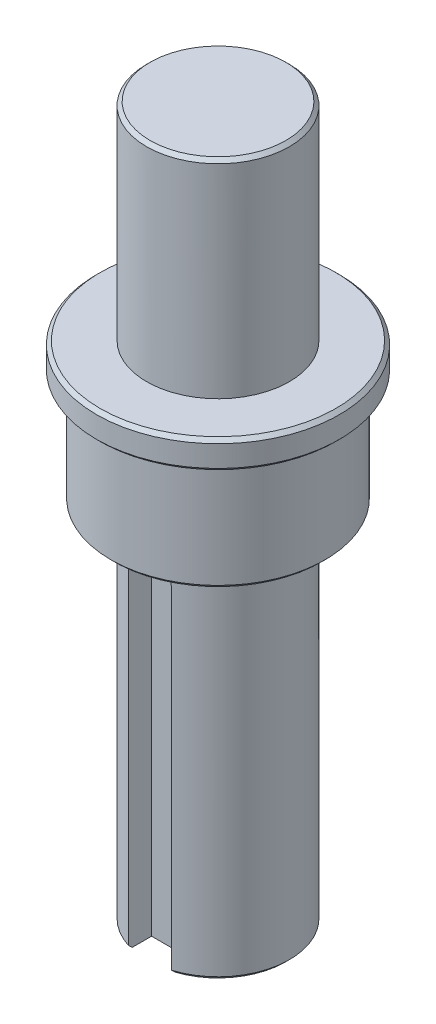
ISO-10303-21;
HEADER;
FILE_DESCRIPTION(('STEP AP214'),'2;1');
FILE_NAME('part.step','',(''),(''),'','','');
FILE_SCHEMA(('AUTOMOTIVE_DESIGN { 1 0 10303 214 1 1 1 1 }'));
ENDSEC;
DATA;
#1=APPLICATION_CONTEXT('core data for automotive mechanical design processes');
#2=APPLICATION_PROTOCOL_DEFINITION('international standard','automotive_design',2000,#1);
#3=PRODUCT_CONTEXT('',#1,'mechanical');
#4=PRODUCT('Part','Part','',(#3));
#5=PRODUCT_RELATED_PRODUCT_CATEGORY('part','',(#4));
#6=PRODUCT_DEFINITION_FORMATION('','',#4);
#7=PRODUCT_DEFINITION_CONTEXT('part definition',#1,'design');
#8=PRODUCT_DEFINITION('design','',#6,#7);
#9=PRODUCT_DEFINITION_SHAPE('','',#8);
#10=(LENGTH_UNIT() NAMED_UNIT(*) SI_UNIT(.MILLI.,.METRE.));
#11=(NAMED_UNIT(*) PLANE_ANGLE_UNIT() SI_UNIT($,.RADIAN.));
#12=(NAMED_UNIT(*) SI_UNIT($,.STERADIAN.) SOLID_ANGLE_UNIT());
#13=UNCERTAINTY_MEASURE_WITH_UNIT(LENGTH_MEASURE(1.E-05),#10,'distance_accuracy_value','');
#14=(GEOMETRIC_REPRESENTATION_CONTEXT(3) GLOBAL_UNCERTAINTY_ASSIGNED_CONTEXT((#13)) GLOBAL_UNIT_ASSIGNED_CONTEXT((#10,
#11,#12)) REPRESENTATION_CONTEXT('',''));
#15=CARTESIAN_POINT('',(0.,0.,0.));
#16=DIRECTION('',(0.,0.,1.));
#17=DIRECTION('',(1.,0.,0.));
#18=AXIS2_PLACEMENT_3D('',#15,#16,#17);
#19=CARTESIAN_POINT('',(0.,55.3655780461796,0.));
#20=DIRECTION('',(0.,1.,0.));
#21=DIRECTION('',(0.,0.,1.));
#22=AXIS2_PLACEMENT_3D('',#19,#20,#21);
#23=PLANE('',#22);
#24=CARTESIAN_POINT('',(0.,55.3655780461796,0.));
#25=DIRECTION('',(0.,1.,0.));
#26=DIRECTION('',(0.,0.,1.));
#27=AXIS2_PLACEMENT_3D('',#24,#25,#26);
#28=CIRCLE('',#27,4.75000000000002);
#29=CARTESIAN_POINT('',(0.,55.3655780461796,4.75000000000002));
#30=VERTEX_POINT('',#29);
#31=EDGE_CURVE('E164',#30,#30,#28,.T.);
#32=ORIENTED_EDGE('',*,*,#31,.T.);
#33=EDGE_LOOP('',(#32));
#34=FACE_BOUND('',#33,.T.);
#35=ADVANCED_FACE('F32',(#34),#23,.T.);
#36=CARTESIAN_POINT('',(0.,0.,0.));
#37=DIRECTION('',(0.,-1.,0.));
#38=DIRECTION('',(0.,0.,-1.));
#39=AXIS2_PLACEMENT_3D('',#36,#37,#38);
#40=CYLINDRICAL_SURFACE('',#39,5.);
#41=CARTESIAN_POINT('',(0.,55.1155780461796,0.));
#42=DIRECTION('',(0.,1.,0.));
#43=DIRECTION('',(0.,0.,1.));
#44=AXIS2_PLACEMENT_3D('',#41,#42,#43);
#45=CIRCLE('',#44,5.);
#46=CARTESIAN_POINT('',(0.,55.1155780461796,5.));
#47=VERTEX_POINT('',#46);
#48=EDGE_CURVE('E161',#47,#47,#45,.F.);
#49=ORIENTED_EDGE('',*,*,#48,.T.);
#50=EDGE_LOOP('',(#49));
#51=FACE_BOUND('',#50,.T.);
#52=CARTESIAN_POINT('',(0.,40.8655780461796,0.));
#53=DIRECTION('',(0.,-1.,0.));
#54=DIRECTION('',(0.,0.,-1.));
#55=AXIS2_PLACEMENT_3D('',#52,#53,#54);
#56=CIRCLE('',#55,5.);
#57=CARTESIAN_POINT('',(0.,40.8655780461796,-5.));
#58=VERTEX_POINT('',#57);
#59=EDGE_CURVE('E129',#58,#58,#56,.T.);
#60=ORIENTED_EDGE('',*,*,#59,.F.);
#61=EDGE_LOOP('',(#60));
#62=FACE_BOUND('',#61,.T.);
#63=ADVANCED_FACE('F238',(#51,#62),#40,.T.);
#64=CARTESIAN_POINT('',(5.,40.8655780461796,0.));
#65=DIRECTION('',(0.,1.,0.));
#66=DIRECTION('',(0.,0.,1.));
#67=AXIS2_PLACEMENT_3D('',#64,#65,#66);
#68=PLANE('',#67);
#69=CARTESIAN_POINT('',(0.,40.8655780461796,0.));
#70=DIRECTION('',(0.,1.,0.));
#71=DIRECTION('',(0.,0.,1.));
#72=AXIS2_PLACEMENT_3D('',#69,#70,#71);
#73=CIRCLE('',#72,8.24999999999998);
#74=CARTESIAN_POINT('',(0.,40.8655780461796,8.24999999999998));
#75=VERTEX_POINT('',#74);
#76=EDGE_CURVE('E147',#75,#75,#73,.T.);
#77=ORIENTED_EDGE('',*,*,#76,.T.);
#78=EDGE_LOOP('',(#77));
#79=FACE_BOUND('',#78,.T.);
#80=ORIENTED_EDGE('',*,*,#59,.T.);
#81=EDGE_LOOP('',(#80));
#82=FACE_BOUND('',#81,.T.);
#83=ADVANCED_FACE('F244',(#79,#82),#68,.T.);
#84=CARTESIAN_POINT('',(0.,0.,0.));
#85=DIRECTION('',(0.,-1.,0.));
#86=DIRECTION('',(0.,0.,-1.));
#87=AXIS2_PLACEMENT_3D('',#84,#85,#86);
#88=CYLINDRICAL_SURFACE('',#87,8.5);
#89=CARTESIAN_POINT('',(0.,39.1155780461796,0.));
#90=DIRECTION('',(0.,-1.,0.));
#91=DIRECTION('',(0.,0.,-1.));
#92=AXIS2_PLACEMENT_3D('',#89,#90,#91);
#93=CIRCLE('',#92,8.5);
#94=CARTESIAN_POINT('',(0.,39.1155780461796,-8.5));
#95=VERTEX_POINT('',#94);
#96=EDGE_CURVE('E144',#95,#95,#93,.F.);
#97=ORIENTED_EDGE('',*,*,#96,.T.);
#98=EDGE_LOOP('',(#97));
#99=FACE_BOUND('',#98,.T.);
#100=CARTESIAN_POINT('',(0.,40.6155780461796,0.));
#101=DIRECTION('',(0.,1.,0.));
#102=DIRECTION('',(0.,0.,1.));
#103=AXIS2_PLACEMENT_3D('',#100,#101,#102);
#104=CIRCLE('',#103,8.5);
#105=CARTESIAN_POINT('',(0.,40.6155780461796,8.5));
#106=VERTEX_POINT('',#105);
#107=EDGE_CURVE('E141',#106,#106,#104,.F.);
#108=ORIENTED_EDGE('',*,*,#107,.T.);
#109=EDGE_LOOP('',(#108));
#110=FACE_BOUND('',#109,.T.);
#111=ADVANCED_FACE('F348',(#99,#110),#88,.T.);
#112=CARTESIAN_POINT('',(8.5,38.8655780461796,0.));
#113=DIRECTION('',(0.,-1.,0.));
#114=DIRECTION('',(0.,0.,-1.));
#115=AXIS2_PLACEMENT_3D('',#112,#113,#114);
#116=PLANE('',#115);
#117=CARTESIAN_POINT('',(0.,38.8655780461796,0.));
#118=DIRECTION('',(0.,-1.,0.));
#119=DIRECTION('',(0.,0.,-1.));
#120=AXIS2_PLACEMENT_3D('',#117,#118,#119);
#121=CIRCLE('',#120,8.25);
#122=CARTESIAN_POINT('',(0.,38.8655780461796,-8.25));
#123=VERTEX_POINT('',#122);
#124=EDGE_CURVE('E138',#123,#123,#121,.T.);
#125=ORIENTED_EDGE('',*,*,#124,.T.);
#126=EDGE_LOOP('',(#125));
#127=FACE_BOUND('',#126,.T.);
#128=CARTESIAN_POINT('',(0.,38.8655780461796,0.));
#129=DIRECTION('',(0.,-1.,0.));
#130=DIRECTION('',(0.,0.,-1.));
#131=AXIS2_PLACEMENT_3D('',#128,#129,#130);
#132=CIRCLE('',#131,7.5);
#133=CARTESIAN_POINT('',(0.,38.8655780461796,-7.5));
#134=VERTEX_POINT('',#133);
#135=EDGE_CURVE('E126',#134,#134,#132,.T.);
#136=ORIENTED_EDGE('',*,*,#135,.F.);
#137=EDGE_LOOP('',(#136));
#138=FACE_BOUND('',#137,.T.);
#139=ADVANCED_FACE('F341',(#127,#138),#116,.T.);
#140=CARTESIAN_POINT('',(0.,0.,0.));
#141=DIRECTION('',(0.,-1.,0.));
#142=DIRECTION('',(0.,0.,-1.));
#143=AXIS2_PLACEMENT_3D('',#140,#141,#142);
#144=CYLINDRICAL_SURFACE('',#143,7.5);
#145=CARTESIAN_POINT('',(0.,31.3155780461796,0.));
#146=DIRECTION('',(0.,-1.,0.));
#147=DIRECTION('',(0.,0.,-1.));
#148=AXIS2_PLACEMENT_3D('',#145,#146,#147);
#149=CIRCLE('',#148,7.5);
#150=CARTESIAN_POINT('',(0.,31.3155780461796,-7.5));
#151=VERTEX_POINT('',#150);
#152=EDGE_CURVE('E135',#151,#151,#149,.F.);
#153=ORIENTED_EDGE('',*,*,#152,.T.);
#154=EDGE_LOOP('',(#153));
#155=FACE_BOUND('',#154,.T.);
#156=ORIENTED_EDGE('',*,*,#135,.T.);
#157=EDGE_LOOP('',(#156));
#158=FACE_BOUND('',#157,.T.);
#159=ADVANCED_FACE('F336',(#155,#158),#144,.T.);
#160=CARTESIAN_POINT('',(7.5,31.0655780461796,0.));
#161=DIRECTION('',(0.,-1.,0.));
#162=DIRECTION('',(0.,0.,-1.));
#163=AXIS2_PLACEMENT_3D('',#160,#161,#162);
#164=PLANE('',#163);
#165=CARTESIAN_POINT('',(0.,31.0655780461796,0.));
#166=DIRECTION('',(0.,-1.,0.));
#167=DIRECTION('',(0.,0.,-1.));
#168=AXIS2_PLACEMENT_3D('',#165,#166,#167);
#169=CIRCLE('',#168,7.25000000000002);
#170=CARTESIAN_POINT('',(0.,31.0655780461796,-7.25000000000002));
#171=VERTEX_POINT('',#170);
#172=EDGE_CURVE('E132',#171,#171,#169,.T.);
#173=ORIENTED_EDGE('',*,*,#172,.T.);
#174=EDGE_LOOP('',(#173));
#175=FACE_BOUND('',#174,.T.);
#176=CARTESIAN_POINT('',(0.,31.0655780461796,0.));
#177=DIRECTION('',(0.,-1.,0.));
#178=DIRECTION('',(0.,0.,-1.));
#179=AXIS2_PLACEMENT_3D('',#176,#177,#178);
#180=CIRCLE('',#179,5.);
#181=CARTESIAN_POINT('',(0.,31.0655780461796,-5.));
#182=VERTEX_POINT('',#181);
#183=EDGE_CURVE('E123',#182,#182,#180,.T.);
#184=ORIENTED_EDGE('',*,*,#183,.F.);
#185=EDGE_LOOP('',(#184));
#186=FACE_BOUND('',#185,.T.);
#187=ADVANCED_FACE('F210',(#175,#186),#164,.T.);
#188=CARTESIAN_POINT('',(0.,0.,0.));
#189=DIRECTION('',(0.,-1.,0.));
#190=DIRECTION('',(0.,0.,-1.));
#191=AXIS2_PLACEMENT_3D('',#188,#189,#190);
#192=CYLINDRICAL_SURFACE('',#191,5.);
#193=DIRECTION('',(0.,-1.,0.));
#194=VECTOR('',#193,1.);
#195=CARTESIAN_POINT('',(-1.5,0.,4.76969600708473));
#196=LINE('',#195,#194);
#197=CARTESIAN_POINT('',(-1.5,29.0655780461796,4.76969600708473));
#198=VERTEX_POINT('',#197);
#199=CARTESIAN_POINT('',(-1.5,5.81557804617957,4.76969600708473));
#200=VERTEX_POINT('',#199);
#201=EDGE_CURVE('E118',#198,#200,#196,.T.);
#202=ORIENTED_EDGE('',*,*,#201,.F.);
#203=CARTESIAN_POINT('',(-1.5,29.0655780461796,4.76969600708473));
#204=CARTESIAN_POINT('',(-1.50000085359987,29.1067588568557,4.76969248993095));
#205=CARTESIAN_POINT('',(-1.49830305374632,29.1479189250242,4.77023000663726));
#206=CARTESIAN_POINT('',(-1.49153727481279,29.2299248430673,4.77235113343356));
#207=CARTESIAN_POINT('',(-1.48647005385463,29.2707707615349,4.7739345082043));
#208=CARTESIAN_POINT('',(-1.46630065235378,29.3921740899327,4.78018533002168));
#209=CARTESIAN_POINT('',(-1.44623028637151,29.4718871065223,4.78635397305579));
#210=CARTESIAN_POINT('',(-1.39353147335906,29.6266123274067,4.80195939037488));
#211=CARTESIAN_POINT('',(-1.36090719903445,29.7016260840324,4.81139507864529));
#212=CARTESIAN_POINT('',(-1.28407985018232,29.8451724452828,4.8324653260204));
#213=CARTESIAN_POINT('',(-1.23987100279312,29.9137017953376,4.8441009806121));
#214=CARTESIAN_POINT('',(-1.13964930893702,30.0444432152147,4.86866818200433));
#215=CARTESIAN_POINT('',(-1.08333633607985,30.1064199966792,4.88162718483485));
#216=CARTESIAN_POINT('',(-0.961140113903204,30.2202123641536,4.90714781796852));
#217=CARTESIAN_POINT('',(-0.89525500200505,30.2720259679565,4.9197093703538));
#218=CARTESIAN_POINT('',(-0.754090160225416,30.3650558233472,4.94333592434221));
#219=CARTESIAN_POINT('',(-0.678642338077991,30.4060269492916,4.95436400128813));
#220=CARTESIAN_POINT('',(-0.521563369050344,30.4745847769378,4.97335005202751));
#221=CARTESIAN_POINT('',(-0.439937649841662,30.5021830732554,4.98131068415016));
#222=CARTESIAN_POINT('',(-0.298264456021696,30.5368470073067,4.99143710038863));
#223=CARTESIAN_POINT('',(-0.239166490668787,30.5475994120532,4.99462764738927));
#224=CARTESIAN_POINT('',(-0.12005739141902,30.5619720635374,4.998918178526));
#225=CARTESIAN_POINT('',(-0.0600465820525057,30.565594787908,5.00001888889585));
#226=CARTESIAN_POINT('',(0.,30.5655780461796,5.));
#227=B_SPLINE_CURVE_WITH_KNOTS('',3,(#203,#204,#205,#206,#207,#208,#209,#210,#211,#212,#213,
#214,#215,#216,#217,#218,#219,#220,#221,#222,#223,#224,#225,#226),.UNSPECIFIED.,.F.,.F.,(4,2,2,
2,2,2,2,2,2,2,2,4),(0.,0.123463321048064,0.24689887216849,0.492911372366583,0.738842172727399,
0.984895759946682,1.23795183323011,1.49105721311967,1.74947248420819,2.00766329935825,
2.1876802778492,2.36763468764484),.UNSPECIFIED.);
#228=CARTESIAN_POINT('',(0.,30.5655780461796,5.));
#229=VERTEX_POINT('',#228);
#230=EDGE_CURVE('E11',#198,#229,#227,.T.);
#231=ORIENTED_EDGE('',*,*,#230,.T.);
#232=CARTESIAN_POINT('',(0.,30.5655780461796,5.));
#233=CARTESIAN_POINT('',(0.0412230773899808,30.5655787870539,5.00000277613313));
#234=CARTESIAN_POINT('',(0.0824255570982469,30.5638776069156,4.99948958398081));
#235=CARTESIAN_POINT('',(0.164518730866948,30.5570976301866,4.99746087704899));
#236=CARTESIAN_POINT('',(0.205409485177794,30.5520195039418,4.9959455611979));
#237=CARTESIAN_POINT('',(0.326963301776202,30.5318028708759,4.98995381331756));
#238=CARTESIAN_POINT('',(0.406785158642714,30.5116816969559,4.98403118606551));
#239=CARTESIAN_POINT('',(0.561734538434264,30.4588351670383,4.96895678681409));
#240=CARTESIAN_POINT('',(0.636863069535107,30.4261125288633,4.95980571114645));
#241=CARTESIAN_POINT('',(0.780600785691843,30.3490549515031,4.93922435519071));
#242=CARTESIAN_POINT('',(0.849207204843492,30.3047151153591,4.92779311423827));
#243=CARTESIAN_POINT('',(0.97986969539363,30.2043564797735,4.90350796272656));
#244=CARTESIAN_POINT('',(1.0417124952522,30.1480671774607,4.8906250718143));
#245=CARTESIAN_POINT('',(1.15524422121796,30.025974419819,4.86505948668359));
#246=CARTESIAN_POINT('',(1.20693049442307,29.9601684865012,4.85237684556416));
#247=CARTESIAN_POINT('',(1.29981663905891,29.8190842149488,4.82833698781928));
#248=CARTESIAN_POINT('',(1.34075062074078,29.7436241491111,4.81701657361784));
#249=CARTESIAN_POINT('',(1.40923482373452,29.5865232188316,4.79742985037451));
#250=CARTESIAN_POINT('',(1.43679764279335,29.5048882562876,4.78916066835566));
#251=CARTESIAN_POINT('',(1.47137173672671,29.36331012738,4.77862845517374));
#252=CARTESIAN_POINT('',(1.48208442594249,29.3043243465226,4.77530350348452));
#253=CARTESIAN_POINT('',(1.49640626854262,29.1854306551123,4.7708262463819));
#254=CARTESIAN_POINT('',(1.5000169977961,29.1255229521007,4.76967345898471));
#255=CARTESIAN_POINT('',(1.5,29.0655780461796,4.76969600708473));
#256=B_SPLINE_CURVE_WITH_KNOTS('',3,(#232,#233,#234,#235,#236,#237,#238,#239,#240,#241,#242,
#243,#244,#245,#246,#247,#248,#249,#250,#251,#252,#253,#254,#255),.UNSPECIFIED.,.F.,.F.,(4,2,2,
2,2,2,2,2,2,2,2,4),(0.,0.123590522760266,0.247156519315276,0.493467728235494,0.73972584367575,
0.98608793095597,1.23877207809718,1.49152213929097,1.75003354782293,2.00830092246139,
2.18798745648376,2.36763411497588),.UNSPECIFIED.);
#257=CARTESIAN_POINT('',(1.5,29.0655780461796,4.76969600708473));
#258=VERTEX_POINT('',#257);
#259=EDGE_CURVE('E42',#229,#258,#256,.T.);
#260=ORIENTED_EDGE('',*,*,#259,.T.);
#261=DIRECTION('',(0.,-1.,0.));
#262=VECTOR('',#261,1.);
#263=CARTESIAN_POINT('',(1.5,0.,4.76969600708473));
#264=LINE('',#263,#262);
#265=CARTESIAN_POINT('',(1.5,5.81557804617957,4.76969600708473));
#266=VERTEX_POINT('',#265);
#267=EDGE_CURVE('E114',#266,#258,#264,.F.);
#268=ORIENTED_EDGE('',*,*,#267,.F.);
#269=CARTESIAN_POINT('',(0.,5.81557804617957,0.));
#270=DIRECTION('',(0.,-1.,0.));
#271=DIRECTION('',(0.,0.,-1.));
#272=AXIS2_PLACEMENT_3D('',#269,#270,#271);
#273=CIRCLE('',#272,5.);
#274=EDGE_CURVE('E158',#266,#200,#273,.F.);
#275=ORIENTED_EDGE('',*,*,#274,.T.);
#276=EDGE_LOOP('',(#202,#231,#260,#268,#275));
#277=FACE_BOUND('',#276,.T.);
#278=ORIENTED_EDGE('',*,*,#183,.T.);
#279=EDGE_LOOP('',(#278));
#280=FACE_BOUND('',#279,.T.);
#281=ADVANCED_FACE('F206',(#277,#280),#192,.T.);
#282=CARTESIAN_POINT('',(5.,5.56557804617958,0.));
#283=DIRECTION('',(0.,-1.,0.));
#284=DIRECTION('',(0.,0.,-1.));
#285=AXIS2_PLACEMENT_3D('',#282,#283,#284);
#286=PLANE('',#285);
#287=DIRECTION('',(0.,0.,-1.));
#288=VECTOR('',#287,1.);
#289=CARTESIAN_POINT('',(-1.5,5.56557804617958,6.15));
#290=LINE('',#289,#288);
#291=CARTESIAN_POINT('',(-1.5,5.56557804617958,4.50693909432999));
#292=VERTEX_POINT('',#291);
#293=CARTESIAN_POINT('',(-1.5,5.56557804617958,3.15));
#294=VERTEX_POINT('',#293);
#295=EDGE_CURVE('E101',#292,#294,#290,.T.);
#296=ORIENTED_EDGE('',*,*,#295,.F.);
#297=CARTESIAN_POINT('',(0.,5.56557804617958,0.));
#298=DIRECTION('',(0.,-1.,0.));
#299=DIRECTION('',(0.,0.,-1.));
#300=AXIS2_PLACEMENT_3D('',#297,#298,#299);
#301=CIRCLE('',#300,4.75);
#302=CARTESIAN_POINT('',(1.5,5.56557804617958,4.50693909432999));
#303=VERTEX_POINT('',#302);
#304=EDGE_CURVE('E153',#292,#303,#301,.T.);
#305=ORIENTED_EDGE('',*,*,#304,.T.);
#306=DIRECTION('',(0.,0.,1.));
#307=VECTOR('',#306,1.);
#308=CARTESIAN_POINT('',(1.5,5.56557804617958,6.15));
#309=LINE('',#308,#307);
#310=CARTESIAN_POINT('',(1.5,5.56557804617958,3.15));
#311=VERTEX_POINT('',#310);
#312=EDGE_CURVE('E98',#311,#303,#309,.T.);
#313=ORIENTED_EDGE('',*,*,#312,.F.);
#314=DIRECTION('',(1.,0.,0.));
#315=VECTOR('',#314,1.);
#316=CARTESIAN_POINT('',(-1.5,5.56557804617958,3.15));
#317=LINE('',#316,#315);
#318=EDGE_CURVE('E93',#294,#311,#317,.T.);
#319=ORIENTED_EDGE('',*,*,#318,.F.);
#320=EDGE_LOOP('',(#296,#305,#313,#319));
#321=FACE_BOUND('',#320,.T.);
#322=CARTESIAN_POINT('',(0.,5.56557804617958,0.));
#323=DIRECTION('',(0.,-1.,0.));
#324=DIRECTION('',(0.,0.,-1.));
#325=AXIS2_PLACEMENT_3D('',#322,#323,#324);
#326=CIRCLE('',#325,1.9);
#327=CARTESIAN_POINT('',(0.,5.56557804617958,-1.9));
#328=VERTEX_POINT('',#327);
#329=EDGE_CURVE('E155',#328,#328,#326,.F.);
#330=ORIENTED_EDGE('',*,*,#329,.T.);
#331=EDGE_LOOP('',(#330));
#332=FACE_BOUND('',#331,.T.);
#333=ADVANCED_FACE('F109',(#321,#332),#286,.T.);
#334=CARTESIAN_POINT('',(0.,15.5655780461796,0.));
#335=DIRECTION('',(0.,-1.,0.));
#336=DIRECTION('',(0.,0.,-1.));
#337=AXIS2_PLACEMENT_3D('',#334,#335,#336);
#338=CONICAL_SURFACE('',#337,1.65,1.02974425867665);
#339=CARTESIAN_POINT('',(0.,16.5569980675751,0.));
#340=VERTEX_POINT('',#339);
#341=VERTEX_LOOP('',#340);
#342=FACE_BOUND('',#341,.T.);
#343=CARTESIAN_POINT('',(0.,15.5655780461796,0.));
#344=DIRECTION('',(0.,-1.,0.));
#345=DIRECTION('',(0.,0.,-1.));
#346=AXIS2_PLACEMENT_3D('',#343,#344,#345);
#347=CIRCLE('',#346,1.65);
#348=CARTESIAN_POINT('',(0.,15.5655780461796,-1.65));
#349=VERTEX_POINT('',#348);
#350=EDGE_CURVE('E120',#349,#349,#347,.T.);
#351=ORIENTED_EDGE('',*,*,#350,.T.);
#352=EDGE_LOOP('',(#351));
#353=FACE_BOUND('',#352,.T.);
#354=ADVANCED_FACE('F199',(#342,#353),#338,.F.);
#355=CARTESIAN_POINT('',(0.,5.56557804617958,0.));
#356=DIRECTION('',(0.,-1.,0.));
#357=DIRECTION('',(0.,0.,-1.));
#358=AXIS2_PLACEMENT_3D('',#355,#356,#357);
#359=CYLINDRICAL_SURFACE('',#358,1.65);
#360=CARTESIAN_POINT('',(0.,5.81557804617958,0.));
#361=DIRECTION('',(0.,-1.,0.));
#362=DIRECTION('',(0.,0.,-1.));
#363=AXIS2_PLACEMENT_3D('',#360,#361,#362);
#364=CIRCLE('',#363,1.65);
#365=CARTESIAN_POINT('',(0.,5.81557804617958,-1.65));
#366=VERTEX_POINT('',#365);
#367=EDGE_CURVE('E150',#366,#366,#364,.T.);
#368=ORIENTED_EDGE('',*,*,#367,.T.);
#369=EDGE_LOOP('',(#368));
#370=FACE_BOUND('',#369,.T.);
#371=ORIENTED_EDGE('',*,*,#350,.F.);
#372=EDGE_LOOP('',(#371));
#373=FACE_BOUND('',#372,.T.);
#374=ADVANCED_FACE('F195',(#370,#373),#359,.F.);
#375=CARTESIAN_POINT('',(0.,31.0655780461796,0.));
#376=DIRECTION('',(0.,1.,0.));
#377=DIRECTION('',(0.,0.,1.));
#378=AXIS2_PLACEMENT_3D('',#375,#376,#377);
#379=CONICAL_SURFACE('',#378,7.25000000000002,0.785398163397443);
#380=ORIENTED_EDGE('',*,*,#152,.F.);
#381=EDGE_LOOP('',(#380));
#382=FACE_BOUND('',#381,.T.);
#383=ORIENTED_EDGE('',*,*,#172,.F.);
#384=EDGE_LOOP('',(#383));
#385=FACE_BOUND('',#384,.T.);
#386=ADVANCED_FACE('F198',(#382,#385),#379,.T.);
#387=CARTESIAN_POINT('',(0.,38.8655780461796,0.));
#388=DIRECTION('',(0.,1.,0.));
#389=DIRECTION('',(0.,0.,1.));
#390=AXIS2_PLACEMENT_3D('',#387,#388,#389);
#391=CONICAL_SURFACE('',#390,8.25,0.785398163397448);
#392=ORIENTED_EDGE('',*,*,#96,.F.);
#393=EDGE_LOOP('',(#392));
#394=FACE_BOUND('',#393,.T.);
#395=ORIENTED_EDGE('',*,*,#124,.F.);
#396=EDGE_LOOP('',(#395));
#397=FACE_BOUND('',#396,.T.);
#398=ADVANCED_FACE('F251',(#394,#397),#391,.T.);
#399=CARTESIAN_POINT('',(0.,40.6155780461796,0.));
#400=DIRECTION('',(0.,-1.,0.));
#401=DIRECTION('',(0.,0.,-1.));
#402=AXIS2_PLACEMENT_3D('',#399,#400,#401);
#403=CONICAL_SURFACE('',#402,8.5,0.785398163397455);
#404=ORIENTED_EDGE('',*,*,#76,.F.);
#405=EDGE_LOOP('',(#404));
#406=FACE_BOUND('',#405,.T.);
#407=ORIENTED_EDGE('',*,*,#107,.F.);
#408=EDGE_LOOP('',(#407));
#409=FACE_BOUND('',#408,.T.);
#410=ADVANCED_FACE('F255',(#406,#409),#403,.T.);
#411=CARTESIAN_POINT('',(0.,5.81557804617958,0.));
#412=DIRECTION('',(0.,-1.,0.));
#413=DIRECTION('',(0.,0.,-1.));
#414=AXIS2_PLACEMENT_3D('',#411,#412,#413);
#415=CONICAL_SURFACE('',#414,1.65,0.785398163397437);
#416=ORIENTED_EDGE('',*,*,#329,.F.);
#417=EDGE_LOOP('',(#416));
#418=FACE_BOUND('',#417,.T.);
#419=ORIENTED_EDGE('',*,*,#367,.F.);
#420=EDGE_LOOP('',(#419));
#421=FACE_BOUND('',#420,.T.);
#422=ADVANCED_FACE('F233',(#418,#421),#415,.F.);
#423=CARTESIAN_POINT('',(0.,5.56557804617958,0.));
#424=DIRECTION('',(0.,1.,0.));
#425=DIRECTION('',(0.,0.,1.));
#426=AXIS2_PLACEMENT_3D('',#423,#424,#425);
#427=CONICAL_SURFACE('',#426,4.75,0.785398163397455);
#428=CARTESIAN_POINT('',(-1.5,7.89533460774791,6.91902832564446));
#429=CARTESIAN_POINT('',(-1.5,7.69647598334168,6.71553036797981));
#430=CARTESIAN_POINT('',(-1.5,7.49779954301674,6.51185357771266));
#431=CARTESIAN_POINT('',(-1.5,7.10098930384228,6.10398960654604));
#432=CARTESIAN_POINT('',(-1.5,6.90285548158691,5.89980244841184));
#433=CARTESIAN_POINT('',(-1.5,6.5073678458266,5.49082637246406));
#434=CARTESIAN_POINT('',(-1.5,6.31001376007984,5.28603771817635));
#435=CARTESIAN_POINT('',(-1.5,5.91628042457067,4.87550503869363));
#436=CARTESIAN_POINT('',(-1.5,5.7199012243852,4.66976096592086));
#437=CARTESIAN_POINT('',(-1.5,5.32845111293506,4.25680529238506));
#438=CARTESIAN_POINT('',(-1.5,5.13338101159559,4.04959292165795));
#439=CARTESIAN_POINT('',(-1.5,4.8424390790512,3.73724813314499));
#440=CARTESIAN_POINT('',(-1.5,4.74574148899583,3.6328852475839));
#441=CARTESIAN_POINT('',(-1.5,4.55305150555913,3.42350587425253));
#442=CARTESIAN_POINT('',(-1.5,4.4570591264121,3.31848937336798));
#443=CARTESIAN_POINT('',(-1.5,4.26594122041828,3.10757123419417));
#444=CARTESIAN_POINT('',(-1.5,4.17081616218705,3.00166917054749));
#445=CARTESIAN_POINT('',(-1.5,3.98179320751965,2.78878442607102));
#446=CARTESIAN_POINT('',(-1.5,3.88789524217197,2.68180180652687));
#447=CARTESIAN_POINT('',(-1.5,3.7017325294011,2.46634201067023));
#448=CARTESIAN_POINT('',(-1.5,3.60946845916267,2.35786424633837));
#449=CARTESIAN_POINT('',(-1.5,3.47285965508976,2.19364182998888));
#450=CARTESIAN_POINT('',(-1.5,3.42761703293877,2.13864473575473));
#451=CARTESIAN_POINT('',(-1.5,3.33786793225311,2.02804855440028));
#452=CARTESIAN_POINT('',(-1.5,3.29336149481503,1.97244943395737));
#453=CARTESIAN_POINT('',(-1.5,3.24929430164179,1.91650066843216));
#454=B_SPLINE_CURVE_WITH_KNOTS('',3,(#428,#429,#430,#431,#432,#433,#434,#435,#436,#437,#438,
#439,#440,#441,#442,#443,#444,#445,#446,#447,#448,#449,#450,#451,#452,#453),.UNSPECIFIED.,.F.,
.F.,(4,2,2,2,2,2,2,2,2,2,2,2,4),(0.,0.853584670418638,1.70713192247078,2.56034877988345,
3.41360859129956,4.26735498184592,4.69417608101149,5.12100577178529,5.54805383278679,
5.9750778075097,6.40227480935119,6.61591414221781,6.82956536125783),.UNSPECIFIED.);
#455=EDGE_CURVE('E104',#200,#292,#454,.T.);
#456=ORIENTED_EDGE('',*,*,#455,.F.);
#457=ORIENTED_EDGE('',*,*,#274,.F.);
#458=CARTESIAN_POINT('',(1.5,3.24929430164179,1.91650066843216));
#459=CARTESIAN_POINT('',(1.5,3.32302412288285,2.01004380284105));
#460=CARTESIAN_POINT('',(1.5,3.39792495714748,2.10264501170143));
#461=CARTESIAN_POINT('',(1.5,3.54953814779825,2.286332118577));
#462=CARTESIAN_POINT('',(1.5,3.62625023437719,2.37741823887959));
#463=CARTESIAN_POINT('',(1.5,3.78095218870356,2.55844148706309));
#464=CARTESIAN_POINT('',(1.5,3.85894162911681,2.64837898198863));
#465=CARTESIAN_POINT('',(1.5,4.01592507115388,2.82737869688168));
#466=CARTESIAN_POINT('',(1.5,4.09491911544865,2.91644087938317));
#467=CARTESIAN_POINT('',(1.5,4.33296946533679,3.1825083203277));
#468=CARTESIAN_POINT('',(1.5,4.49317305647103,3.3584859783545));
#469=CARTESIAN_POINT('',(1.5,4.81552443674137,3.7086663476505));
#470=CARTESIAN_POINT('',(1.5,4.9776723630063,3.88286893210659));
#471=CARTESIAN_POINT('',(1.5,5.20425174871498,4.12444003880721));
#472=CARTESIAN_POINT('',(1.5,5.26812352187248,4.19233446960438));
#473=CARTESIAN_POINT('',(1.5,5.39604850698609,4.3279575977517));
#474=CARTESIAN_POINT('',(1.5,5.46010172645213,4.39568628801917));
#475=CARTESIAN_POINT('',(1.5,5.71995134681018,4.66982075394263));
#476=CARTESIAN_POINT('',(1.5,5.91638805027015,4.87561965678679));
#477=CARTESIAN_POINT('',(1.5,6.31024431246382,5.28627570759393));
#478=CARTESIAN_POINT('',(1.5,6.50766387767489,5.49113284933324));
#479=CARTESIAN_POINT('',(1.5,6.90316343000021,5.90012054678869));
#480=CARTESIAN_POINT('',(1.5,7.10124326135089,6.10425125321795));
#481=CARTESIAN_POINT('',(1.5,7.49793306612436,6.51199021657896));
#482=CARTESIAN_POINT('',(1.5,7.69654303038245,6.71559848242461));
#483=CARTESIAN_POINT('',(1.5,7.89533460774791,6.91902832564446));
#484=B_SPLINE_CURVE_WITH_KNOTS('',3,(#458,#459,#460,#461,#462,#463,#464,#465,#466,#467,#468,
#469,#470,#471,#472,#473,#474,#475,#476,#477,#478,#479,#480,#481,#482,#483),.UNSPECIFIED.,.F.,
.F.,(4,2,2,2,2,2,2,2,2,2,2,2,4),(0.,0.357289307053713,0.714525723346356,1.07164497444426,
1.42877944532866,2.14268564208744,2.8566424884237,3.13629080885794,3.41595087798695,
4.26944687365721,5.12294850160169,5.97626131375108,6.82955946852391),.UNSPECIFIED.);
#485=EDGE_CURVE('E167',#303,#266,#484,.T.);
#486=ORIENTED_EDGE('',*,*,#485,.F.);
#487=ORIENTED_EDGE('',*,*,#304,.F.);
#488=EDGE_LOOP('',(#456,#457,#486,#487));
#489=FACE_BOUND('',#488,.T.);
#490=ADVANCED_FACE('F181',(#489),#427,.T.);
#491=CARTESIAN_POINT('',(0.,55.1155780461796,0.));
#492=DIRECTION('',(0.,-1.,0.));
#493=DIRECTION('',(0.,0.,-1.));
#494=AXIS2_PLACEMENT_3D('',#491,#492,#493);
#495=CONICAL_SURFACE('',#494,5.,0.785398163397428);
#496=ORIENTED_EDGE('',*,*,#31,.F.);
#497=EDGE_LOOP('',(#496));
#498=FACE_BOUND('',#497,.T.);
#499=ORIENTED_EDGE('',*,*,#48,.F.);
#500=EDGE_LOOP('',(#499));
#501=FACE_BOUND('',#500,.T.);
#502=ADVANCED_FACE('F194',(#498,#501),#495,.T.);
#503=CARTESIAN_POINT('',(-1.5,30.5655780461796,6.15));
#504=DIRECTION('',(-1.,0.,0.));
#505=DIRECTION('',(0.,0.,1.));
#506=AXIS2_PLACEMENT_3D('',#503,#504,#505);
#507=PLANE('',#506);
#508=DIRECTION('',(0.,-1.,0.));
#509=VECTOR('',#508,1.);
#510=CARTESIAN_POINT('',(-1.5,30.5655780461796,3.15));
#511=LINE('',#510,#509);
#512=CARTESIAN_POINT('',(-1.5,29.0655780461796,3.15));
#513=VERTEX_POINT('',#512);
#514=EDGE_CURVE('E88',#513,#294,#511,.T.);
#515=ORIENTED_EDGE('',*,*,#514,.F.);
#516=DIRECTION('',(0.,0.,-1.));
#517=VECTOR('',#516,1.);
#518=CARTESIAN_POINT('',(-1.5,29.0655780461796,6.15));
#519=LINE('',#518,#517);
#520=EDGE_CURVE('E55',#513,#198,#519,.F.);
#521=ORIENTED_EDGE('',*,*,#520,.T.);
#522=ORIENTED_EDGE('',*,*,#201,.T.);
#523=ORIENTED_EDGE('',*,*,#455,.T.);
#524=ORIENTED_EDGE('',*,*,#295,.T.);
#525=EDGE_LOOP('',(#515,#521,#522,#523,#524));
#526=FACE_BOUND('',#525,.T.);
#527=ADVANCED_FACE('F102',(#526),#507,.F.);
#528=CARTESIAN_POINT('',(1.5,30.5655780461796,6.15));
#529=DIRECTION('',(1.,0.,0.));
#530=DIRECTION('',(0.,0.,-1.));
#531=AXIS2_PLACEMENT_3D('',#528,#529,#530);
#532=PLANE('',#531);
#533=ORIENTED_EDGE('',*,*,#267,.T.);
#534=DIRECTION('',(0.,0.,1.));
#535=VECTOR('',#534,1.);
#536=CARTESIAN_POINT('',(1.5,29.0655780461796,6.15));
#537=LINE('',#536,#535);
#538=CARTESIAN_POINT('',(1.5,29.0655780461796,3.15));
#539=VERTEX_POINT('',#538);
#540=EDGE_CURVE('E325',#258,#539,#537,.F.);
#541=ORIENTED_EDGE('',*,*,#540,.T.);
#542=DIRECTION('',(0.,-1.,0.));
#543=VECTOR('',#542,1.);
#544=CARTESIAN_POINT('',(1.5,30.5655780461796,3.15));
#545=LINE('',#544,#543);
#546=EDGE_CURVE('E97',#539,#311,#545,.T.);
#547=ORIENTED_EDGE('',*,*,#546,.T.);
#548=ORIENTED_EDGE('',*,*,#312,.T.);
#549=ORIENTED_EDGE('',*,*,#485,.T.);
#550=EDGE_LOOP('',(#533,#541,#547,#548,#549));
#551=FACE_BOUND('',#550,.T.);
#552=ADVANCED_FACE('F185',(#551),#532,.F.);
#553=CARTESIAN_POINT('',(-1.5,30.5655780461796,3.15));
#554=DIRECTION('',(0.,0.,-1.));
#555=DIRECTION('',(-1.,0.,0.));
#556=AXIS2_PLACEMENT_3D('',#553,#554,#555);
#557=PLANE('',#556);
#558=ORIENTED_EDGE('',*,*,#546,.F.);
#559=CARTESIAN_POINT('',(0.,29.0655780461796,3.15));
#560=DIRECTION('',(0.,0.,-1.));
#561=DIRECTION('',(-1.,0.,0.));
#562=AXIS2_PLACEMENT_3D('',#559,#560,#561);
#563=CIRCLE('',#562,1.5);
#564=CARTESIAN_POINT('',(0.,30.5655780461796,3.15));
#565=VERTEX_POINT('',#564);
#566=EDGE_CURVE('E324',#539,#565,#563,.F.);
#567=ORIENTED_EDGE('',*,*,#566,.T.);
#568=CARTESIAN_POINT('',(0.,29.0655780461796,3.15));
#569=DIRECTION('',(0.,0.,-1.));
#570=DIRECTION('',(-1.,0.,0.));
#571=AXIS2_PLACEMENT_3D('',#568,#569,#570);
#572=CIRCLE('',#571,1.5);
#573=EDGE_CURVE('E96',#565,#513,#572,.F.);
#574=ORIENTED_EDGE('',*,*,#573,.T.);
#575=ORIENTED_EDGE('',*,*,#514,.T.);
#576=ORIENTED_EDGE('',*,*,#318,.T.);
#577=EDGE_LOOP('',(#558,#567,#574,#575,#576));
#578=FACE_BOUND('',#577,.T.);
#579=ADVANCED_FACE('F91',(#578),#557,.F.);
#580=CARTESIAN_POINT('',(0.,29.0655780461796,0.));
#581=DIRECTION('',(0.,0.,-1.));
#582=DIRECTION('',(-1.,0.,0.));
#583=AXIS2_PLACEMENT_3D('',#580,#581,#582);
#584=CYLINDRICAL_SURFACE('',#583,1.5);
#585=ORIENTED_EDGE('',*,*,#520,.F.);
#586=ORIENTED_EDGE('',*,*,#573,.F.);
#587=DIRECTION('',(0.,0.,-1.));
#588=VECTOR('',#587,1.);
#589=CARTESIAN_POINT('',(0.,30.5655780461796,0.));
#590=LINE('',#589,#588);
#591=EDGE_CURVE('E37',#229,#565,#590,.T.);
#592=ORIENTED_EDGE('',*,*,#591,.F.);
#593=ORIENTED_EDGE('',*,*,#230,.F.);
#594=EDGE_LOOP('',(#585,#586,#592,#593));
#595=FACE_BOUND('',#594,.T.);
#596=ADVANCED_FACE('F34',(#595),#584,.F.);
#597=CARTESIAN_POINT('',(0.,29.0655780461796,0.));
#598=DIRECTION('',(0.,0.,1.));
#599=DIRECTION('',(1.,0.,0.));
#600=AXIS2_PLACEMENT_3D('',#597,#598,#599);
#601=CYLINDRICAL_SURFACE('',#600,1.5);
#602=ORIENTED_EDGE('',*,*,#566,.F.);
#603=ORIENTED_EDGE('',*,*,#540,.F.);
#604=ORIENTED_EDGE('',*,*,#259,.F.);
#605=ORIENTED_EDGE('',*,*,#591,.T.);
#606=EDGE_LOOP('',(#602,#603,#604,#605));
#607=FACE_BOUND('',#606,.T.);
#608=ADVANCED_FACE('F224',(#607),#601,.F.);
#609=CLOSED_SHELL('',(#35,#63,#83,#111,#139,#159,#187,#281,#333,#354,#374,#386,#398,#410,#422,
#490,#502,#527,#552,#579,#596,#608));
#610=MANIFOLD_SOLID_BREP('B2',#609);
#611=ADVANCED_BREP_SHAPE_REPRESENTATION('',(#18,#610),#14);
#612=SHAPE_DEFINITION_REPRESENTATION(#9,#611);
ENDSEC;
END-ISO-10303-21;
